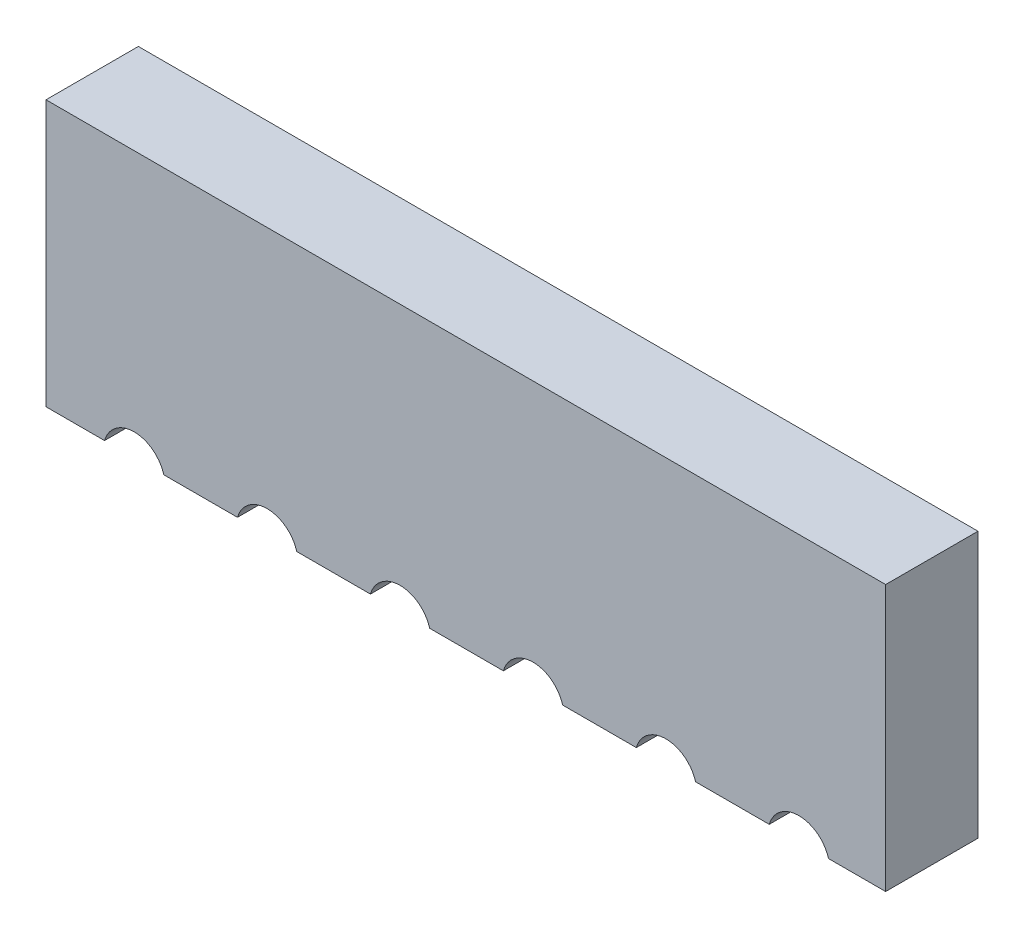
ISO-10303-21;
HEADER;
FILE_DESCRIPTION(('STEP AP214'),'2;1');
FILE_NAME('part.step','',(''),(''),'','','');
FILE_SCHEMA(('AUTOMOTIVE_DESIGN { 1 0 10303 214 1 1 1 1 }'));
ENDSEC;
DATA;
#1=APPLICATION_CONTEXT('core data for automotive mechanical design processes');
#2=APPLICATION_PROTOCOL_DEFINITION('international standard','automotive_design',2000,#1);
#3=PRODUCT_CONTEXT('',#1,'mechanical');
#4=PRODUCT('Part','Part','',(#3));
#5=PRODUCT_RELATED_PRODUCT_CATEGORY('part','',(#4));
#6=PRODUCT_DEFINITION_FORMATION('','',#4);
#7=PRODUCT_DEFINITION_CONTEXT('part definition',#1,'design');
#8=PRODUCT_DEFINITION('design','',#6,#7);
#9=PRODUCT_DEFINITION_SHAPE('','',#8);
#10=(LENGTH_UNIT() NAMED_UNIT(*) SI_UNIT(.MILLI.,.METRE.));
#11=(NAMED_UNIT(*) PLANE_ANGLE_UNIT() SI_UNIT($,.RADIAN.));
#12=(NAMED_UNIT(*) SI_UNIT($,.STERADIAN.) SOLID_ANGLE_UNIT());
#13=UNCERTAINTY_MEASURE_WITH_UNIT(LENGTH_MEASURE(1.E-05),#10,'distance_accuracy_value','');
#14=(GEOMETRIC_REPRESENTATION_CONTEXT(3) GLOBAL_UNCERTAINTY_ASSIGNED_CONTEXT((#13)) GLOBAL_UNIT_ASSIGNED_CONTEXT((#10,
#11,#12)) REPRESENTATION_CONTEXT('',''));
#15=CARTESIAN_POINT('',(0.,0.,0.));
#16=DIRECTION('',(0.,0.,1.));
#17=DIRECTION('',(1.,0.,0.));
#18=AXIS2_PLACEMENT_3D('',#15,#16,#17);
#19=CARTESIAN_POINT('',(0.000263147942937,-0.030887294380958,0.33));
#20=DIRECTION('',(0.,0.,1.));
#21=DIRECTION('',(1.,0.,0.));
#22=AXIS2_PLACEMENT_3D('',#19,#20,#21);
#23=PLANE('',#22);
#24=DIRECTION('',(0.,1.,0.));
#25=VECTOR('',#24,1.);
#26=CARTESIAN_POINT('',(3.,0.950000000000045,0.33));
#27=LINE('',#26,#25);
#28=CARTESIAN_POINT('',(3.,0.950000000000045,0.33));
#29=VERTEX_POINT('',#28);
#30=CARTESIAN_POINT('',(3.,-0.949999999999932,0.33));
#31=VERTEX_POINT('',#30);
#32=EDGE_CURVE('E177',#29,#31,#27,.F.);
#33=ORIENTED_EDGE('',*,*,#32,.F.);
#34=DIRECTION('',(1.,0.,0.));
#35=VECTOR('',#34,1.);
#36=CARTESIAN_POINT('',(-3.,0.950000000000045,0.33));
#37=LINE('',#36,#35);
#38=CARTESIAN_POINT('',(-3.,0.950000000000045,0.33));
#39=VERTEX_POINT('',#38);
#40=EDGE_CURVE('E167',#39,#29,#37,.T.);
#41=ORIENTED_EDGE('',*,*,#40,.F.);
#42=DIRECTION('',(0.,1.,0.));
#43=VECTOR('',#42,1.);
#44=CARTESIAN_POINT('',(-3.,-0.949999999999932,0.33));
#45=LINE('',#44,#43);
#46=CARTESIAN_POINT('',(-3.,-0.949999999999932,0.33));
#47=VERTEX_POINT('',#46);
#48=EDGE_CURVE('E130',#47,#39,#45,.T.);
#49=ORIENTED_EDGE('',*,*,#48,.F.);
#50=DIRECTION('',(1.,0.,0.));
#51=VECTOR('',#50,1.);
#52=CARTESIAN_POINT('',(0.000263147942937,-0.949999999999932,0.33));
#53=LINE('',#52,#51);
#54=CARTESIAN_POINT('',(-2.5816601048851,-0.949999999999932,0.33));
#55=VERTEX_POINT('',#54);
#56=EDGE_CURVE('E125',#47,#55,#53,.T.);
#57=ORIENTED_EDGE('',*,*,#56,.T.);
#58=CARTESIAN_POINT('',(-2.36999999999995,-1.00999999999993,0.33));
#59=DIRECTION('',(0.,0.,1.));
#60=DIRECTION('',(1.,0.,0.));
#61=AXIS2_PLACEMENT_3D('',#58,#59,#60);
#62=CIRCLE('',#61,0.22);
#63=CARTESIAN_POINT('',(-2.15833989511479,-0.949999999999932,0.33));
#64=VERTEX_POINT('',#63);
#65=EDGE_CURVE('E19',#55,#64,#62,.F.);
#66=ORIENTED_EDGE('',*,*,#65,.T.);
#67=DIRECTION('',(1.,0.,0.));
#68=VECTOR('',#67,1.);
#69=CARTESIAN_POINT('',(-1.6316601048851,-0.949999999999932,0.33));
#70=LINE('',#69,#68);
#71=CARTESIAN_POINT('',(-1.63166010488512,-0.949999999999929,0.33));
#72=VERTEX_POINT('',#71);
#73=EDGE_CURVE('E139',#72,#64,#70,.F.);
#74=ORIENTED_EDGE('',*,*,#73,.F.);
#75=CARTESIAN_POINT('',(-1.41999999999996,-1.00999999999993,0.33));
#76=DIRECTION('',(0.,0.,1.));
#77=DIRECTION('',(1.,0.,0.));
#78=AXIS2_PLACEMENT_3D('',#75,#76,#77);
#79=CIRCLE('',#78,0.22);
#80=CARTESIAN_POINT('',(-1.20833989511481,-0.949999999999932,0.33));
#81=VERTEX_POINT('',#80);
#82=EDGE_CURVE('E214',#72,#81,#79,.F.);
#83=ORIENTED_EDGE('',*,*,#82,.T.);
#84=DIRECTION('',(1.,0.,0.));
#85=VECTOR('',#84,1.);
#86=CARTESIAN_POINT('',(-0.681660104885111,-0.949999999999932,0.33));
#87=LINE('',#86,#85);
#88=CARTESIAN_POINT('',(-0.681660104885136,-0.949999999999929,0.33));
#89=VERTEX_POINT('',#88);
#90=EDGE_CURVE('E210',#89,#81,#87,.F.);
#91=ORIENTED_EDGE('',*,*,#90,.F.);
#92=CARTESIAN_POINT('',(-0.46999999999997,-1.00999999999993,0.33));
#93=DIRECTION('',(0.,0.,1.));
#94=DIRECTION('',(1.,0.,0.));
#95=AXIS2_PLACEMENT_3D('',#92,#93,#94);
#96=CIRCLE('',#95,0.22);
#97=CARTESIAN_POINT('',(-0.258339895114825,-0.949999999999875,0.33));
#98=VERTEX_POINT('',#97);
#99=EDGE_CURVE('E207',#89,#98,#96,.F.);
#100=ORIENTED_EDGE('',*,*,#99,.T.);
#101=DIRECTION('',(1.,0.,0.));
#102=VECTOR('',#101,1.);
#103=CARTESIAN_POINT('',(0.268339895114877,-0.949999999999875,0.33));
#104=LINE('',#103,#102);
#105=CARTESIAN_POINT('',(0.268339895114868,-0.949999999999874,0.33));
#106=VERTEX_POINT('',#105);
#107=EDGE_CURVE('E203',#106,#98,#104,.F.);
#108=ORIENTED_EDGE('',*,*,#107,.F.);
#109=CARTESIAN_POINT('',(0.480000000000018,-1.00999999999993,0.33));
#110=DIRECTION('',(0.,0.,1.));
#111=DIRECTION('',(1.,0.,0.));
#112=AXIS2_PLACEMENT_3D('',#109,#110,#111);
#113=CIRCLE('',#112,0.22);
#114=CARTESIAN_POINT('',(0.69166010488518,-0.949999999999989,0.33));
#115=VERTEX_POINT('',#114);
#116=EDGE_CURVE('E200',#106,#115,#113,.F.);
#117=ORIENTED_EDGE('',*,*,#116,.T.);
#118=DIRECTION('',(1.,0.,0.));
#119=VECTOR('',#118,1.);
#120=CARTESIAN_POINT('',(1.21833989511481,-0.949999999999989,0.33));
#121=LINE('',#120,#119);
#122=CARTESIAN_POINT('',(1.21833989511482,-0.949999999999991,0.33));
#123=VERTEX_POINT('',#122);
#124=EDGE_CURVE('E196',#123,#115,#121,.F.);
#125=ORIENTED_EDGE('',*,*,#124,.F.);
#126=CARTESIAN_POINT('',(1.43000000000001,-1.00999999999993,0.33));
#127=DIRECTION('',(0.,0.,1.));
#128=DIRECTION('',(1.,0.,0.));
#129=AXIS2_PLACEMENT_3D('',#126,#127,#128);
#130=CIRCLE('',#129,0.22);
#131=CARTESIAN_POINT('',(1.6416601048852,-0.949999999999989,0.33));
#132=VERTEX_POINT('',#131);
#133=EDGE_CURVE('E193',#123,#132,#130,.F.);
#134=ORIENTED_EDGE('',*,*,#133,.T.);
#135=DIRECTION('',(1.,0.,0.));
#136=VECTOR('',#135,1.);
#137=CARTESIAN_POINT('',(2.1683398951148,-0.949999999999989,0.33));
#138=LINE('',#137,#136);
#139=CARTESIAN_POINT('',(2.16833989511481,-0.949999999999991,0.33));
#140=VERTEX_POINT('',#139);
#141=EDGE_CURVE('E189',#140,#132,#138,.F.);
#142=ORIENTED_EDGE('',*,*,#141,.F.);
#143=CARTESIAN_POINT('',(2.38,-1.00999999999993,0.33));
#144=DIRECTION('',(0.,0.,1.));
#145=DIRECTION('',(1.,0.,0.));
#146=AXIS2_PLACEMENT_3D('',#143,#144,#145);
#147=CIRCLE('',#146,0.22);
#148=CARTESIAN_POINT('',(2.59166010488518,-0.949999999999932,0.33));
#149=VERTEX_POINT('',#148);
#150=EDGE_CURVE('E186',#140,#149,#147,.F.);
#151=ORIENTED_EDGE('',*,*,#150,.T.);
#152=DIRECTION('',(1.,0.,0.));
#153=VECTOR('',#152,1.);
#154=CARTESIAN_POINT('',(3.,-0.949999999999932,0.33));
#155=LINE('',#154,#153);
#156=EDGE_CURVE('E182',#31,#149,#155,.F.);
#157=ORIENTED_EDGE('',*,*,#156,.F.);
#158=EDGE_LOOP('',(#33,#41,#49,#57,#66,#74,#83,#91,#100,#108,#117,#125,#134,#142,#151,#157));
#159=FACE_BOUND('',#158,.T.);
#160=ADVANCED_FACE('F16',(#159),#23,.T.);
#161=CARTESIAN_POINT('',(-2.36999999999995,-1.00999999999993,-0.33));
#162=DIRECTION('',(0.,0.,1.));
#163=DIRECTION('',(1.,0.,0.));
#164=AXIS2_PLACEMENT_3D('',#161,#162,#163);
#165=CYLINDRICAL_SURFACE('',#164,0.22);
#166=DIRECTION('',(0.,0.,-1.));
#167=VECTOR('',#166,1.);
#168=CARTESIAN_POINT('',(-2.58166010488509,-0.949999999999932,-0.33));
#169=LINE('',#168,#167);
#170=CARTESIAN_POINT('',(-2.5816601048851,-0.949999999999932,-0.33));
#171=VERTEX_POINT('',#170);
#172=EDGE_CURVE('E137',#171,#55,#169,.F.);
#173=ORIENTED_EDGE('',*,*,#172,.F.);
#174=CARTESIAN_POINT('',(-2.36999999999995,-1.00999999999993,-0.33));
#175=DIRECTION('',(0.,0.,1.));
#176=DIRECTION('',(1.,0.,0.));
#177=AXIS2_PLACEMENT_3D('',#174,#175,#176);
#178=CIRCLE('',#177,0.22);
#179=CARTESIAN_POINT('',(-2.15833989511479,-0.949999999999932,-0.33));
#180=VERTEX_POINT('',#179);
#181=EDGE_CURVE('E141',#171,#180,#178,.F.);
#182=ORIENTED_EDGE('',*,*,#181,.T.);
#183=DIRECTION('',(0.,0.,-1.));
#184=VECTOR('',#183,1.);
#185=CARTESIAN_POINT('',(-2.15833989511481,-0.949999999999932,-0.33));
#186=LINE('',#185,#184);
#187=EDGE_CURVE('E138',#64,#180,#186,.T.);
#188=ORIENTED_EDGE('',*,*,#187,.F.);
#189=ORIENTED_EDGE('',*,*,#65,.F.);
#190=EDGE_LOOP('',(#173,#182,#188,#189));
#191=FACE_BOUND('',#190,.T.);
#192=ADVANCED_FACE('F135',(#191),#165,.F.);
#193=CARTESIAN_POINT('',(-1.6316601048851,-0.949999999999932,-0.33));
#194=DIRECTION('',(0.,-1.,0.));
#195=DIRECTION('',(0.,0.,-1.));
#196=AXIS2_PLACEMENT_3D('',#193,#194,#195);
#197=PLANE('',#196);
#198=DIRECTION('',(1.,0.,0.));
#199=VECTOR('',#198,1.);
#200=CARTESIAN_POINT('',(0.000263147942937,-0.949999999999932,-0.33));
#201=LINE('',#200,#199);
#202=CARTESIAN_POINT('',(-1.63166010488512,-0.949999999999929,-0.33));
#203=VERTEX_POINT('',#202);
#204=EDGE_CURVE('E143',#180,#203,#201,.T.);
#205=ORIENTED_EDGE('',*,*,#204,.T.);
#206=DIRECTION('',(0.,0.,1.));
#207=VECTOR('',#206,1.);
#208=CARTESIAN_POINT('',(-1.63166010488512,-0.949999999999925,-0.33));
#209=LINE('',#208,#207);
#210=EDGE_CURVE('E211',#203,#72,#209,.T.);
#211=ORIENTED_EDGE('',*,*,#210,.T.);
#212=ORIENTED_EDGE('',*,*,#73,.T.);
#213=ORIENTED_EDGE('',*,*,#187,.T.);
#214=EDGE_LOOP('',(#205,#211,#212,#213));
#215=FACE_BOUND('',#214,.T.);
#216=ADVANCED_FACE('F454',(#215),#197,.T.);
#217=CARTESIAN_POINT('',(-1.41999999999996,-1.00999999999993,-0.33));
#218=DIRECTION('',(0.,0.,1.));
#219=DIRECTION('',(1.,0.,0.));
#220=AXIS2_PLACEMENT_3D('',#217,#218,#219);
#221=CYLINDRICAL_SURFACE('',#220,0.22);
#222=ORIENTED_EDGE('',*,*,#210,.F.);
#223=CARTESIAN_POINT('',(-1.41999999999996,-1.00999999999993,-0.33));
#224=DIRECTION('',(0.,0.,1.));
#225=DIRECTION('',(1.,0.,0.));
#226=AXIS2_PLACEMENT_3D('',#223,#224,#225);
#227=CIRCLE('',#226,0.22);
#228=CARTESIAN_POINT('',(-1.20833989511481,-0.949999999999932,-0.33));
#229=VERTEX_POINT('',#228);
#230=EDGE_CURVE('E252',#203,#229,#227,.F.);
#231=ORIENTED_EDGE('',*,*,#230,.T.);
#232=DIRECTION('',(0.,0.,-1.));
#233=VECTOR('',#232,1.);
#234=CARTESIAN_POINT('',(-1.20833989511482,-0.949999999999932,-0.33));
#235=LINE('',#234,#233);
#236=EDGE_CURVE('E208',#81,#229,#235,.T.);
#237=ORIENTED_EDGE('',*,*,#236,.F.);
#238=ORIENTED_EDGE('',*,*,#82,.F.);
#239=EDGE_LOOP('',(#222,#231,#237,#238));
#240=FACE_BOUND('',#239,.T.);
#241=ADVANCED_FACE('F267',(#240),#221,.F.);
#242=CARTESIAN_POINT('',(-0.681660104885111,-0.949999999999932,-0.33));
#243=DIRECTION('',(0.,-1.,0.));
#244=DIRECTION('',(0.,0.,-1.));
#245=AXIS2_PLACEMENT_3D('',#242,#243,#244);
#246=PLANE('',#245);
#247=DIRECTION('',(1.,0.,0.));
#248=VECTOR('',#247,1.);
#249=CARTESIAN_POINT('',(0.000263147942937,-0.949999999999932,-0.33));
#250=LINE('',#249,#248);
#251=CARTESIAN_POINT('',(-0.681660104885136,-0.949999999999929,-0.33));
#252=VERTEX_POINT('',#251);
#253=EDGE_CURVE('E251',#229,#252,#250,.T.);
#254=ORIENTED_EDGE('',*,*,#253,.T.);
#255=DIRECTION('',(0.,0.,1.));
#256=VECTOR('',#255,1.);
#257=CARTESIAN_POINT('',(-0.681660104885135,-0.949999999999925,-0.33));
#258=LINE('',#257,#256);
#259=EDGE_CURVE('E204',#252,#89,#258,.T.);
#260=ORIENTED_EDGE('',*,*,#259,.T.);
#261=ORIENTED_EDGE('',*,*,#90,.T.);
#262=ORIENTED_EDGE('',*,*,#236,.T.);
#263=EDGE_LOOP('',(#254,#260,#261,#262));
#264=FACE_BOUND('',#263,.T.);
#265=ADVANCED_FACE('F272',(#264),#246,.T.);
#266=CARTESIAN_POINT('',(-0.46999999999997,-1.00999999999993,-0.33));
#267=DIRECTION('',(0.,0.,1.));
#268=DIRECTION('',(1.,0.,0.));
#269=AXIS2_PLACEMENT_3D('',#266,#267,#268);
#270=CYLINDRICAL_SURFACE('',#269,0.22);
#271=ORIENTED_EDGE('',*,*,#259,.F.);
#272=CARTESIAN_POINT('',(-0.46999999999997,-1.00999999999993,-0.33));
#273=DIRECTION('',(0.,0.,1.));
#274=DIRECTION('',(1.,0.,0.));
#275=AXIS2_PLACEMENT_3D('',#272,#273,#274);
#276=CIRCLE('',#275,0.22);
#277=CARTESIAN_POINT('',(-0.258339895114817,-0.949999999999904,-0.33));
#278=VERTEX_POINT('',#277);
#279=EDGE_CURVE('E248',#252,#278,#276,.F.);
#280=ORIENTED_EDGE('',*,*,#279,.T.);
#281=DIRECTION('',(0.,0.,-1.));
#282=VECTOR('',#281,1.);
#283=CARTESIAN_POINT('',(-0.25833989511483,-0.949999999999875,-0.33));
#284=LINE('',#283,#282);
#285=EDGE_CURVE('E201',#98,#278,#284,.T.);
#286=ORIENTED_EDGE('',*,*,#285,.F.);
#287=ORIENTED_EDGE('',*,*,#99,.F.);
#288=EDGE_LOOP('',(#271,#280,#286,#287));
#289=FACE_BOUND('',#288,.T.);
#290=ADVANCED_FACE('F323',(#289),#270,.F.);
#291=CARTESIAN_POINT('',(0.268339895114877,-0.949999999999875,-0.33));
#292=DIRECTION('',(0.,-1.,0.));
#293=DIRECTION('',(0.,0.,-1.));
#294=AXIS2_PLACEMENT_3D('',#291,#292,#293);
#295=PLANE('',#294);
#296=DIRECTION('',(1.,0.,0.));
#297=VECTOR('',#296,1.);
#298=CARTESIAN_POINT('',(0.000263147942937,-0.949999999999932,-0.33));
#299=LINE('',#298,#297);
#300=CARTESIAN_POINT('',(0.26833989511486,-0.949999999999902,-0.33));
#301=VERTEX_POINT('',#300);
#302=EDGE_CURVE('E247',#278,#301,#299,.T.);
#303=ORIENTED_EDGE('',*,*,#302,.T.);
#304=DIRECTION('',(0.,0.,1.));
#305=VECTOR('',#304,1.);
#306=CARTESIAN_POINT('',(0.268339895114868,-0.949999999999873,-0.33));
#307=LINE('',#306,#305);
#308=EDGE_CURVE('E197',#301,#106,#307,.T.);
#309=ORIENTED_EDGE('',*,*,#308,.T.);
#310=ORIENTED_EDGE('',*,*,#107,.T.);
#311=ORIENTED_EDGE('',*,*,#285,.T.);
#312=EDGE_LOOP('',(#303,#309,#310,#311));
#313=FACE_BOUND('',#312,.T.);
#314=ADVANCED_FACE('F320',(#313),#295,.T.);
#315=CARTESIAN_POINT('',(0.480000000000018,-1.00999999999993,-0.33));
#316=DIRECTION('',(0.,0.,1.));
#317=DIRECTION('',(1.,0.,0.));
#318=AXIS2_PLACEMENT_3D('',#315,#316,#317);
#319=CYLINDRICAL_SURFACE('',#318,0.22);
#320=ORIENTED_EDGE('',*,*,#308,.F.);
#321=CARTESIAN_POINT('',(0.480000000000018,-1.00999999999993,-0.33));
#322=DIRECTION('',(0.,0.,1.));
#323=DIRECTION('',(1.,0.,0.));
#324=AXIS2_PLACEMENT_3D('',#321,#322,#323);
#325=CIRCLE('',#324,0.22);
#326=CARTESIAN_POINT('',(0.691660104885164,-0.949999999999932,-0.33));
#327=VERTEX_POINT('',#326);
#328=EDGE_CURVE('E244',#301,#327,#325,.F.);
#329=ORIENTED_EDGE('',*,*,#328,.T.);
#330=DIRECTION('',(0.,0.,-1.));
#331=VECTOR('',#330,1.);
#332=CARTESIAN_POINT('',(0.691660104885159,-0.949999999999989,-0.33));
#333=LINE('',#332,#331);
#334=EDGE_CURVE('E194',#115,#327,#333,.T.);
#335=ORIENTED_EDGE('',*,*,#334,.F.);
#336=ORIENTED_EDGE('',*,*,#116,.F.);
#337=EDGE_LOOP('',(#320,#329,#335,#336));
#338=FACE_BOUND('',#337,.T.);
#339=ADVANCED_FACE('F317',(#338),#319,.F.);
#340=CARTESIAN_POINT('',(1.21833989511481,-0.949999999999989,-0.33));
#341=DIRECTION('',(0.,-1.,0.));
#342=DIRECTION('',(0.,0.,-1.));
#343=AXIS2_PLACEMENT_3D('',#340,#341,#342);
#344=PLANE('',#343);
#345=DIRECTION('',(1.,0.,0.));
#346=VECTOR('',#345,1.);
#347=CARTESIAN_POINT('',(0.000263147942937,-0.949999999999875,-0.33));
#348=LINE('',#347,#346);
#349=CARTESIAN_POINT('',(1.21833989511484,-0.949999999999934,-0.33));
#350=VERTEX_POINT('',#349);
#351=EDGE_CURVE('E243',#327,#350,#348,.T.);
#352=ORIENTED_EDGE('',*,*,#351,.T.);
#353=DIRECTION('',(0.,0.,1.));
#354=VECTOR('',#353,1.);
#355=CARTESIAN_POINT('',(1.21833989511482,-0.949999999999993,-0.33));
#356=LINE('',#355,#354);
#357=EDGE_CURVE('E190',#350,#123,#356,.T.);
#358=ORIENTED_EDGE('',*,*,#357,.T.);
#359=ORIENTED_EDGE('',*,*,#124,.T.);
#360=ORIENTED_EDGE('',*,*,#334,.T.);
#361=EDGE_LOOP('',(#352,#358,#359,#360));
#362=FACE_BOUND('',#361,.T.);
#363=ADVANCED_FACE('F313',(#362),#344,.T.);
#364=CARTESIAN_POINT('',(1.43000000000001,-1.00999999999993,-0.33));
#365=DIRECTION('',(0.,0.,1.));
#366=DIRECTION('',(1.,0.,0.));
#367=AXIS2_PLACEMENT_3D('',#364,#365,#366);
#368=CYLINDRICAL_SURFACE('',#367,0.22);
#369=ORIENTED_EDGE('',*,*,#357,.F.);
#370=CARTESIAN_POINT('',(1.43000000000001,-1.00999999999993,-0.33));
#371=DIRECTION('',(0.,0.,1.));
#372=DIRECTION('',(1.,0.,0.));
#373=AXIS2_PLACEMENT_3D('',#370,#371,#372);
#374=CIRCLE('',#373,0.22);
#375=CARTESIAN_POINT('',(1.6416601048852,-0.949999999999989,-0.33));
#376=VERTEX_POINT('',#375);
#377=EDGE_CURVE('E240',#350,#376,#374,.F.);
#378=ORIENTED_EDGE('',*,*,#377,.T.);
#379=DIRECTION('',(0.,0.,-1.));
#380=VECTOR('',#379,1.);
#381=CARTESIAN_POINT('',(1.6416601048852,-0.949999999999989,-0.33));
#382=LINE('',#381,#380);
#383=EDGE_CURVE('E187',#132,#376,#382,.T.);
#384=ORIENTED_EDGE('',*,*,#383,.F.);
#385=ORIENTED_EDGE('',*,*,#133,.F.);
#386=EDGE_LOOP('',(#369,#378,#384,#385));
#387=FACE_BOUND('',#386,.T.);
#388=ADVANCED_FACE('F310',(#387),#368,.F.);
#389=CARTESIAN_POINT('',(2.1683398951148,-0.949999999999989,-0.33));
#390=DIRECTION('',(0.,-1.,0.));
#391=DIRECTION('',(0.,0.,-1.));
#392=AXIS2_PLACEMENT_3D('',#389,#390,#391);
#393=PLANE('',#392);
#394=DIRECTION('',(1.,0.,0.));
#395=VECTOR('',#394,1.);
#396=CARTESIAN_POINT('',(0.000263147942937,-0.949999999999989,-0.33));
#397=LINE('',#396,#395);
#398=CARTESIAN_POINT('',(2.16833989511481,-0.949999999999991,-0.33));
#399=VERTEX_POINT('',#398);
#400=EDGE_CURVE('E239',#376,#399,#397,.T.);
#401=ORIENTED_EDGE('',*,*,#400,.T.);
#402=DIRECTION('',(0.,0.,1.));
#403=VECTOR('',#402,1.);
#404=CARTESIAN_POINT('',(2.16833989511481,-0.949999999999993,-0.33));
#405=LINE('',#404,#403);
#406=EDGE_CURVE('E183',#399,#140,#405,.T.);
#407=ORIENTED_EDGE('',*,*,#406,.T.);
#408=ORIENTED_EDGE('',*,*,#141,.T.);
#409=ORIENTED_EDGE('',*,*,#383,.T.);
#410=EDGE_LOOP('',(#401,#407,#408,#409));
#411=FACE_BOUND('',#410,.T.);
#412=ADVANCED_FACE('F305',(#411),#393,.T.);
#413=CARTESIAN_POINT('',(2.38,-1.00999999999993,-0.33));
#414=DIRECTION('',(0.,0.,1.));
#415=DIRECTION('',(1.,0.,0.));
#416=AXIS2_PLACEMENT_3D('',#413,#414,#415);
#417=CYLINDRICAL_SURFACE('',#416,0.22);
#418=ORIENTED_EDGE('',*,*,#406,.F.);
#419=CARTESIAN_POINT('',(2.38,-1.00999999999993,-0.33));
#420=DIRECTION('',(0.,0.,1.));
#421=DIRECTION('',(1.,0.,0.));
#422=AXIS2_PLACEMENT_3D('',#419,#420,#421);
#423=CIRCLE('',#422,0.22);
#424=CARTESIAN_POINT('',(2.59166010488519,-0.94999999999996,-0.33));
#425=VERTEX_POINT('',#424);
#426=EDGE_CURVE('E236',#399,#425,#423,.F.);
#427=ORIENTED_EDGE('',*,*,#426,.T.);
#428=DIRECTION('',(0.,0.,-1.));
#429=VECTOR('',#428,1.);
#430=CARTESIAN_POINT('',(2.59166010488519,-0.949999999999932,-0.33));
#431=LINE('',#430,#429);
#432=EDGE_CURVE('E180',#149,#425,#431,.T.);
#433=ORIENTED_EDGE('',*,*,#432,.F.);
#434=ORIENTED_EDGE('',*,*,#150,.F.);
#435=EDGE_LOOP('',(#418,#427,#433,#434));
#436=FACE_BOUND('',#435,.T.);
#437=ADVANCED_FACE('F302',(#436),#417,.F.);
#438=CARTESIAN_POINT('',(3.,-0.949999999999932,-0.33));
#439=DIRECTION('',(0.,-1.,0.));
#440=DIRECTION('',(0.,0.,-1.));
#441=AXIS2_PLACEMENT_3D('',#438,#439,#440);
#442=PLANE('',#441);
#443=DIRECTION('',(1.,0.,0.));
#444=VECTOR('',#443,1.);
#445=CARTESIAN_POINT('',(0.000263147942937,-0.949999999999989,-0.33));
#446=LINE('',#445,#444);
#447=CARTESIAN_POINT('',(3.,-0.94999999999997,-0.33));
#448=VERTEX_POINT('',#447);
#449=EDGE_CURVE('E172',#425,#448,#446,.T.);
#450=ORIENTED_EDGE('',*,*,#449,.T.);
#451=DIRECTION('',(0.,0.,-1.));
#452=VECTOR('',#451,1.);
#453=CARTESIAN_POINT('',(3.,-0.949999999999932,-0.33));
#454=LINE('',#453,#452);
#455=EDGE_CURVE('E175',#31,#448,#454,.T.);
#456=ORIENTED_EDGE('',*,*,#455,.F.);
#457=ORIENTED_EDGE('',*,*,#156,.T.);
#458=ORIENTED_EDGE('',*,*,#432,.T.);
#459=EDGE_LOOP('',(#450,#456,#457,#458));
#460=FACE_BOUND('',#459,.T.);
#461=ADVANCED_FACE('F295',(#460),#442,.T.);
#462=CARTESIAN_POINT('',(3.,0.950000000000045,-0.33));
#463=DIRECTION('',(1.,0.,0.));
#464=DIRECTION('',(0.,0.,-1.));
#465=AXIS2_PLACEMENT_3D('',#462,#463,#464);
#466=PLANE('',#465);
#467=DIRECTION('',(0.,1.,0.));
#468=VECTOR('',#467,1.);
#469=CARTESIAN_POINT('',(3.,-0.030887294380958,-0.33));
#470=LINE('',#469,#468);
#471=CARTESIAN_POINT('',(3.,0.950000000000045,-0.33));
#472=VERTEX_POINT('',#471);
#473=EDGE_CURVE('E162',#448,#472,#470,.T.);
#474=ORIENTED_EDGE('',*,*,#473,.T.);
#475=DIRECTION('',(0.,0.,1.));
#476=VECTOR('',#475,1.);
#477=CARTESIAN_POINT('',(3.,0.950000000000045,-0.33));
#478=LINE('',#477,#476);
#479=EDGE_CURVE('E165',#29,#472,#478,.F.);
#480=ORIENTED_EDGE('',*,*,#479,.F.);
#481=ORIENTED_EDGE('',*,*,#32,.T.);
#482=ORIENTED_EDGE('',*,*,#455,.T.);
#483=EDGE_LOOP('',(#474,#480,#481,#482));
#484=FACE_BOUND('',#483,.T.);
#485=ADVANCED_FACE('F328',(#484),#466,.T.);
#486=CARTESIAN_POINT('',(-3.,0.950000000000045,-0.33));
#487=DIRECTION('',(0.,1.,0.));
#488=DIRECTION('',(0.,0.,1.));
#489=AXIS2_PLACEMENT_3D('',#486,#487,#488);
#490=PLANE('',#489);
#491=DIRECTION('',(1.,0.,0.));
#492=VECTOR('',#491,1.);
#493=CARTESIAN_POINT('',(0.000263147942937,0.950000000000045,-0.33));
#494=LINE('',#493,#492);
#495=CARTESIAN_POINT('',(-3.,0.950000000000045,-0.33));
#496=VERTEX_POINT('',#495);
#497=EDGE_CURVE('E154',#472,#496,#494,.F.);
#498=ORIENTED_EDGE('',*,*,#497,.T.);
#499=DIRECTION('',(0.,0.,1.));
#500=VECTOR('',#499,1.);
#501=CARTESIAN_POINT('',(-3.,0.950000000000045,-0.33));
#502=LINE('',#501,#500);
#503=EDGE_CURVE('E145',#39,#496,#502,.F.);
#504=ORIENTED_EDGE('',*,*,#503,.F.);
#505=ORIENTED_EDGE('',*,*,#40,.T.);
#506=ORIENTED_EDGE('',*,*,#479,.T.);
#507=EDGE_LOOP('',(#498,#504,#505,#506));
#508=FACE_BOUND('',#507,.T.);
#509=ADVANCED_FACE('F330',(#508),#490,.T.);
#510=CARTESIAN_POINT('',(-3.,-0.949999999999932,-0.33));
#511=DIRECTION('',(-1.,0.,0.));
#512=DIRECTION('',(0.,0.,1.));
#513=AXIS2_PLACEMENT_3D('',#510,#511,#512);
#514=PLANE('',#513);
#515=DIRECTION('',(0.,1.,0.));
#516=VECTOR('',#515,1.);
#517=CARTESIAN_POINT('',(-3.,-0.030887294380958,-0.33));
#518=LINE('',#517,#516);
#519=CARTESIAN_POINT('',(-3.,-0.949999999999932,-0.33));
#520=VERTEX_POINT('',#519);
#521=EDGE_CURVE('E25',#496,#520,#518,.F.);
#522=ORIENTED_EDGE('',*,*,#521,.T.);
#523=DIRECTION('',(0.,0.,-1.));
#524=VECTOR('',#523,1.);
#525=CARTESIAN_POINT('',(-3.,-0.949999999999932,-0.33));
#526=LINE('',#525,#524);
#527=EDGE_CURVE('E33',#47,#520,#526,.T.);
#528=ORIENTED_EDGE('',*,*,#527,.F.);
#529=ORIENTED_EDGE('',*,*,#48,.T.);
#530=ORIENTED_EDGE('',*,*,#503,.T.);
#531=EDGE_LOOP('',(#522,#528,#529,#530));
#532=FACE_BOUND('',#531,.T.);
#533=ADVANCED_FACE('F332',(#532),#514,.T.);
#534=CARTESIAN_POINT('',(-2.58166010488509,-0.949999999999932,-0.33));
#535=DIRECTION('',(0.,-1.,0.));
#536=DIRECTION('',(0.,0.,-1.));
#537=AXIS2_PLACEMENT_3D('',#534,#535,#536);
#538=PLANE('',#537);
#539=DIRECTION('',(1.,0.,0.));
#540=VECTOR('',#539,1.);
#541=CARTESIAN_POINT('',(0.000263147942937,-0.949999999999932,-0.33));
#542=LINE('',#541,#540);
#543=EDGE_CURVE('E10',#520,#171,#542,.T.);
#544=ORIENTED_EDGE('',*,*,#543,.T.);
#545=ORIENTED_EDGE('',*,*,#172,.T.);
#546=ORIENTED_EDGE('',*,*,#56,.F.);
#547=ORIENTED_EDGE('',*,*,#527,.T.);
#548=EDGE_LOOP('',(#544,#545,#546,#547));
#549=FACE_BOUND('',#548,.T.);
#550=ADVANCED_FACE('F140',(#549),#538,.T.);
#551=CARTESIAN_POINT('',(0.000263147942937,-0.030887294380958,-0.33));
#552=DIRECTION('',(0.,0.,1.));
#553=DIRECTION('',(1.,0.,0.));
#554=AXIS2_PLACEMENT_3D('',#551,#552,#553);
#555=PLANE('',#554);
#556=ORIENTED_EDGE('',*,*,#521,.F.);
#557=ORIENTED_EDGE('',*,*,#497,.F.);
#558=ORIENTED_EDGE('',*,*,#473,.F.);
#559=ORIENTED_EDGE('',*,*,#449,.F.);
#560=ORIENTED_EDGE('',*,*,#426,.F.);
#561=ORIENTED_EDGE('',*,*,#400,.F.);
#562=ORIENTED_EDGE('',*,*,#377,.F.);
#563=ORIENTED_EDGE('',*,*,#351,.F.);
#564=ORIENTED_EDGE('',*,*,#328,.F.);
#565=ORIENTED_EDGE('',*,*,#302,.F.);
#566=ORIENTED_EDGE('',*,*,#279,.F.);
#567=ORIENTED_EDGE('',*,*,#253,.F.);
#568=ORIENTED_EDGE('',*,*,#230,.F.);
#569=ORIENTED_EDGE('',*,*,#204,.F.);
#570=ORIENTED_EDGE('',*,*,#181,.F.);
#571=ORIENTED_EDGE('',*,*,#543,.F.);
#572=EDGE_LOOP('',(#556,#557,#558,#559,#560,#561,#562,#563,#564,#565,#566,#567,#568,#569,#570,#571));
#573=FACE_BOUND('',#572,.T.);
#574=ADVANCED_FACE('F276',(#573),#555,.F.);
#575=CLOSED_SHELL('',(#160,#192,#216,#241,#265,#290,#314,#339,#363,#388,#412,#437,#461,#485,
#509,#533,#550,#574));
#576=MANIFOLD_SOLID_BREP('B1',#575);
#577=ADVANCED_BREP_SHAPE_REPRESENTATION('',(#18,#576),#14);
#578=SHAPE_DEFINITION_REPRESENTATION(#9,#577);
ENDSEC;
END-ISO-10303-21;
